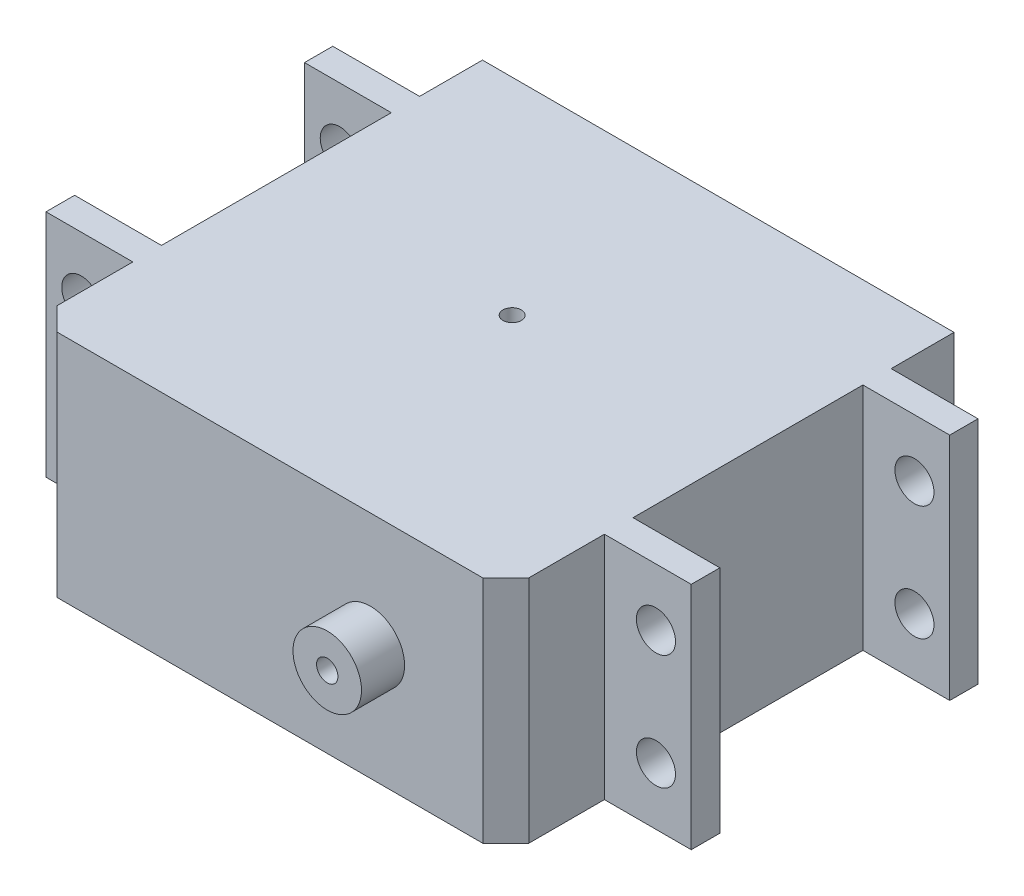
ISO-10303-21;
HEADER;
FILE_DESCRIPTION(('STEP AP214'),'2;1');
FILE_NAME('part.step','',(''),(''),'','','');
FILE_SCHEMA(('AUTOMOTIVE_DESIGN { 1 0 10303 214 1 1 1 1 }'));
ENDSEC;
DATA;
#1=APPLICATION_CONTEXT('core data for automotive mechanical design processes');
#2=APPLICATION_PROTOCOL_DEFINITION('international standard','automotive_design',2000,#1);
#3=PRODUCT_CONTEXT('',#1,'mechanical');
#4=PRODUCT('Part','Part','',(#3));
#5=PRODUCT_RELATED_PRODUCT_CATEGORY('part','',(#4));
#6=PRODUCT_DEFINITION_FORMATION('','',#4);
#7=PRODUCT_DEFINITION_CONTEXT('part definition',#1,'design');
#8=PRODUCT_DEFINITION('design','',#6,#7);
#9=PRODUCT_DEFINITION_SHAPE('','',#8);
#10=(LENGTH_UNIT() NAMED_UNIT(*) SI_UNIT(.MILLI.,.METRE.));
#11=(NAMED_UNIT(*) PLANE_ANGLE_UNIT() SI_UNIT($,.RADIAN.));
#12=(NAMED_UNIT(*) SI_UNIT($,.STERADIAN.) SOLID_ANGLE_UNIT());
#13=UNCERTAINTY_MEASURE_WITH_UNIT(LENGTH_MEASURE(1.E-05),#10,'distance_accuracy_value','');
#14=(GEOMETRIC_REPRESENTATION_CONTEXT(3) GLOBAL_UNCERTAINTY_ASSIGNED_CONTEXT((#13)) GLOBAL_UNIT_ASSIGNED_CONTEXT((#10,
#11,#12)) REPRESENTATION_CONTEXT('',''));
#15=CARTESIAN_POINT('',(0.,0.,0.));
#16=DIRECTION('',(0.,0.,1.));
#17=DIRECTION('',(1.,0.,0.));
#18=AXIS2_PLACEMENT_3D('',#15,#16,#17);
#19=CARTESIAN_POINT('',(-20.515,10.,-27.93));
#20=DIRECTION('',(0.,0.,1.));
#21=DIRECTION('',(1.,0.,0.));
#22=AXIS2_PLACEMENT_3D('',#19,#20,#21);
#23=PLANE('',#22);
#24=DIRECTION('',(0.,-1.,0.));
#25=VECTOR('',#24,1.);
#26=CARTESIAN_POINT('',(-20.515,-10.,-27.93));
#27=LINE('',#26,#25);
#28=CARTESIAN_POINT('',(-20.515,10.,-27.93));
#29=VERTEX_POINT('',#28);
#30=CARTESIAN_POINT('',(-20.515,-10.,-27.93));
#31=VERTEX_POINT('',#30);
#32=EDGE_CURVE('E202',#29,#31,#27,.T.);
#33=ORIENTED_EDGE('',*,*,#32,.F.);
#34=DIRECTION('',(-1.,0.,0.));
#35=VECTOR('',#34,1.);
#36=CARTESIAN_POINT('',(20.515,10.,-27.93));
#37=LINE('',#36,#35);
#38=CARTESIAN_POINT('',(20.515,10.,-27.93));
#39=VERTEX_POINT('',#38);
#40=EDGE_CURVE('E195',#39,#29,#37,.T.);
#41=ORIENTED_EDGE('',*,*,#40,.F.);
#42=DIRECTION('',(0.,1.,0.));
#43=VECTOR('',#42,1.);
#44=CARTESIAN_POINT('',(20.515,-10.,-27.93));
#45=LINE('',#44,#43);
#46=CARTESIAN_POINT('',(20.515,-10.,-27.93));
#47=VERTEX_POINT('',#46);
#48=EDGE_CURVE('E205',#47,#39,#45,.T.);
#49=ORIENTED_EDGE('',*,*,#48,.F.);
#50=DIRECTION('',(1.,0.,0.));
#51=VECTOR('',#50,1.);
#52=CARTESIAN_POINT('',(20.515,-10.,-27.93));
#53=LINE('',#52,#51);
#54=EDGE_CURVE('E188',#31,#47,#53,.T.);
#55=ORIENTED_EDGE('',*,*,#54,.F.);
#56=EDGE_LOOP('',(#33,#41,#49,#55));
#57=FACE_BOUND('',#56,.T.);
#58=CARTESIAN_POINT('',(8.73,0.,-27.93));
#59=DIRECTION('',(0.,0.,1.));
#60=DIRECTION('',(1.,0.,0.));
#61=AXIS2_PLACEMENT_3D('',#58,#59,#60);
#62=CIRCLE('',#61,6.18);
#63=CARTESIAN_POINT('',(14.91,0.,-27.93));
#64=VERTEX_POINT('',#63);
#65=EDGE_CURVE('E12',#64,#64,#62,.F.);
#66=ORIENTED_EDGE('',*,*,#65,.F.);
#67=EDGE_LOOP('',(#66));
#68=FACE_BOUND('',#67,.T.);
#69=ADVANCED_FACE('F34',(#57,#68),#23,.F.);
#70=CARTESIAN_POINT('',(-28.07,9.99999999999999,-22.46));
#71=DIRECTION('',(0.,0.,1.));
#72=DIRECTION('',(1.,0.,0.));
#73=AXIS2_PLACEMENT_3D('',#70,#71,#72);
#74=PLANE('',#73);
#75=CARTESIAN_POINT('',(-25.,-5.,-22.46));
#76=DIRECTION('',(0.,0.,1.));
#77=DIRECTION('',(1.,0.,0.));
#78=AXIS2_PLACEMENT_3D('',#75,#76,#77);
#79=CIRCLE('',#78,1.7);
#80=CARTESIAN_POINT('',(-23.3,-5.,-22.46));
#81=VERTEX_POINT('',#80);
#82=EDGE_CURVE('E241',#81,#81,#79,.T.);
#83=ORIENTED_EDGE('',*,*,#82,.T.);
#84=EDGE_LOOP('',(#83));
#85=FACE_BOUND('',#84,.T.);
#86=CARTESIAN_POINT('',(-25.,5.,-22.46));
#87=DIRECTION('',(0.,0.,1.));
#88=DIRECTION('',(1.,0.,0.));
#89=AXIS2_PLACEMENT_3D('',#86,#87,#88);
#90=CIRCLE('',#89,1.7);
#91=CARTESIAN_POINT('',(-23.3,5.,-22.46));
#92=VERTEX_POINT('',#91);
#93=EDGE_CURVE('E235',#92,#92,#90,.T.);
#94=ORIENTED_EDGE('',*,*,#93,.T.);
#95=EDGE_LOOP('',(#94));
#96=FACE_BOUND('',#95,.T.);
#97=DIRECTION('',(-1.,0.,0.));
#98=VECTOR('',#97,1.);
#99=CARTESIAN_POINT('',(-28.07,10.,-22.46));
#100=LINE('',#99,#98);
#101=CARTESIAN_POINT('',(-20.515,10.,-22.46));
#102=VERTEX_POINT('',#101);
#103=CARTESIAN_POINT('',(-28.07,10.,-22.46));
#104=VERTEX_POINT('',#103);
#105=EDGE_CURVE('E288',#102,#104,#100,.T.);
#106=ORIENTED_EDGE('',*,*,#105,.F.);
#107=DIRECTION('',(0.,-1.,0.));
#108=VECTOR('',#107,1.);
#109=CARTESIAN_POINT('',(-20.515,9.99999999999999,-22.46));
#110=LINE('',#109,#108);
#111=CARTESIAN_POINT('',(-20.515,-10.,-22.46));
#112=VERTEX_POINT('',#111);
#113=EDGE_CURVE('E399',#102,#112,#110,.T.);
#114=ORIENTED_EDGE('',*,*,#113,.T.);
#115=DIRECTION('',(1.,0.,0.));
#116=VECTOR('',#115,1.);
#117=CARTESIAN_POINT('',(-28.07,-10.,-22.46));
#118=LINE('',#117,#116);
#119=CARTESIAN_POINT('',(-28.07,-10.,-22.46));
#120=VERTEX_POINT('',#119);
#121=EDGE_CURVE('E190',#120,#112,#118,.T.);
#122=ORIENTED_EDGE('',*,*,#121,.F.);
#123=DIRECTION('',(0.,-1.,0.));
#124=VECTOR('',#123,1.);
#125=CARTESIAN_POINT('',(-28.07,-10.,-22.46));
#126=LINE('',#125,#124);
#127=EDGE_CURVE('E248',#104,#120,#126,.T.);
#128=ORIENTED_EDGE('',*,*,#127,.F.);
#129=EDGE_LOOP('',(#106,#114,#122,#128));
#130=FACE_BOUND('',#129,.T.);
#131=ADVANCED_FACE('F298',(#85,#96,#130),#74,.F.);
#132=CARTESIAN_POINT('',(-28.07,9.99999999999999,0.));
#133=DIRECTION('',(0.,0.,1.));
#134=DIRECTION('',(1.,0.,0.));
#135=AXIS2_PLACEMENT_3D('',#132,#133,#134);
#136=PLANE('',#135);
#137=CARTESIAN_POINT('',(25.,-5.,0.));
#138=DIRECTION('',(0.,0.,1.));
#139=DIRECTION('',(1.,0.,0.));
#140=AXIS2_PLACEMENT_3D('',#137,#138,#139);
#141=CIRCLE('',#140,1.7);
#142=CARTESIAN_POINT('',(26.7,-5.,0.));
#143=VERTEX_POINT('',#142);
#144=EDGE_CURVE('E959',#143,#143,#141,.T.);
#145=ORIENTED_EDGE('',*,*,#144,.T.);
#146=EDGE_LOOP('',(#145));
#147=FACE_BOUND('',#146,.T.);
#148=CARTESIAN_POINT('',(25.,5.,0.));
#149=DIRECTION('',(0.,0.,1.));
#150=DIRECTION('',(1.,0.,0.));
#151=AXIS2_PLACEMENT_3D('',#148,#149,#150);
#152=CIRCLE('',#151,1.7);
#153=CARTESIAN_POINT('',(26.7,5.,0.));
#154=VERTEX_POINT('',#153);
#155=EDGE_CURVE('E468',#154,#154,#152,.T.);
#156=ORIENTED_EDGE('',*,*,#155,.T.);
#157=EDGE_LOOP('',(#156));
#158=FACE_BOUND('',#157,.T.);
#159=DIRECTION('',(0.,-1.,0.));
#160=VECTOR('',#159,1.);
#161=CARTESIAN_POINT('',(20.515,-10.,0.));
#162=LINE('',#161,#160);
#163=CARTESIAN_POINT('',(20.515,10.,0.));
#164=VERTEX_POINT('',#163);
#165=CARTESIAN_POINT('',(20.515,-10.,0.));
#166=VERTEX_POINT('',#165);
#167=EDGE_CURVE('E257',#164,#166,#162,.T.);
#168=ORIENTED_EDGE('',*,*,#167,.F.);
#169=DIRECTION('',(-1.,0.,0.));
#170=VECTOR('',#169,1.);
#171=CARTESIAN_POINT('',(28.07,10.,0.));
#172=LINE('',#171,#170);
#173=CARTESIAN_POINT('',(28.07,10.,0.));
#174=VERTEX_POINT('',#173);
#175=EDGE_CURVE('E436',#174,#164,#172,.T.);
#176=ORIENTED_EDGE('',*,*,#175,.F.);
#177=DIRECTION('',(0.,1.,0.));
#178=VECTOR('',#177,1.);
#179=CARTESIAN_POINT('',(28.07,-10.,0.));
#180=LINE('',#179,#178);
#181=CARTESIAN_POINT('',(28.07,-10.,0.));
#182=VERTEX_POINT('',#181);
#183=EDGE_CURVE('E446',#182,#174,#180,.T.);
#184=ORIENTED_EDGE('',*,*,#183,.F.);
#185=DIRECTION('',(1.,0.,0.));
#186=VECTOR('',#185,1.);
#187=CARTESIAN_POINT('',(28.07,-10.,0.));
#188=LINE('',#187,#186);
#189=EDGE_CURVE('E324',#166,#182,#188,.T.);
#190=ORIENTED_EDGE('',*,*,#189,.F.);
#191=EDGE_LOOP('',(#168,#176,#184,#190));
#192=FACE_BOUND('',#191,.T.);
#193=ADVANCED_FACE('F434',(#147,#158,#192),#136,.F.);
#194=CARTESIAN_POINT('',(-25.,-5.,0.));
#195=DIRECTION('',(0.,0.,1.));
#196=DIRECTION('',(1.,0.,0.));
#197=AXIS2_PLACEMENT_3D('',#194,#195,#196);
#198=CIRCLE('',#197,1.7);
#199=CARTESIAN_POINT('',(-23.3,-5.,0.));
#200=VERTEX_POINT('',#199);
#201=EDGE_CURVE('E463',#200,#200,#198,.T.);
#202=ORIENTED_EDGE('',*,*,#201,.T.);
#203=EDGE_LOOP('',(#202));
#204=FACE_BOUND('',#203,.T.);
#205=CARTESIAN_POINT('',(-25.,5.,0.));
#206=DIRECTION('',(0.,0.,1.));
#207=DIRECTION('',(1.,0.,0.));
#208=AXIS2_PLACEMENT_3D('',#205,#206,#207);
#209=CIRCLE('',#208,1.7);
#210=CARTESIAN_POINT('',(-23.3,5.,0.));
#211=VERTEX_POINT('',#210);
#212=EDGE_CURVE('E958',#211,#211,#209,.T.);
#213=ORIENTED_EDGE('',*,*,#212,.T.);
#214=EDGE_LOOP('',(#213));
#215=FACE_BOUND('',#214,.T.);
#216=DIRECTION('',(0.,1.,0.));
#217=VECTOR('',#216,1.);
#218=CARTESIAN_POINT('',(-20.515,-10.,0.));
#219=LINE('',#218,#217);
#220=CARTESIAN_POINT('',(-20.515,-10.,0.));
#221=VERTEX_POINT('',#220);
#222=CARTESIAN_POINT('',(-20.515,10.,0.));
#223=VERTEX_POINT('',#222);
#224=EDGE_CURVE('E314',#221,#223,#219,.T.);
#225=ORIENTED_EDGE('',*,*,#224,.F.);
#226=CARTESIAN_POINT('',(-28.07,-10.,0.));
#227=VERTEX_POINT('',#226);
#228=EDGE_CURVE('E506',#227,#221,#188,.T.);
#229=ORIENTED_EDGE('',*,*,#228,.F.);
#230=DIRECTION('',(0.,-1.,0.));
#231=VECTOR('',#230,1.);
#232=CARTESIAN_POINT('',(-28.07,-10.,0.));
#233=LINE('',#232,#231);
#234=CARTESIAN_POINT('',(-28.07,9.99999999999999,0.));
#235=VERTEX_POINT('',#234);
#236=EDGE_CURVE('E486',#235,#227,#233,.T.);
#237=ORIENTED_EDGE('',*,*,#236,.F.);
#238=EDGE_CURVE('E442',#223,#235,#172,.T.);
#239=ORIENTED_EDGE('',*,*,#238,.F.);
#240=EDGE_LOOP('',(#225,#229,#237,#239));
#241=FACE_BOUND('',#240,.T.);
#242=ADVANCED_FACE('F613',(#204,#215,#241),#136,.F.);
#243=CARTESIAN_POINT('',(-20.515,10.,11.07));
#244=DIRECTION('',(0.,0.,1.));
#245=DIRECTION('',(1.,0.,0.));
#246=AXIS2_PLACEMENT_3D('',#243,#244,#245);
#247=PLANE('',#246);
#248=DIRECTION('',(-1.,0.,0.));
#249=VECTOR('',#248,1.);
#250=CARTESIAN_POINT('',(20.515,10.,11.07));
#251=LINE('',#250,#249);
#252=CARTESIAN_POINT('',(18.515,10.,11.07));
#253=VERTEX_POINT('',#252);
#254=CARTESIAN_POINT('',(-18.515,10.,11.07));
#255=VERTEX_POINT('',#254);
#256=EDGE_CURVE('E350',#253,#255,#251,.T.);
#257=ORIENTED_EDGE('',*,*,#256,.T.);
#258=DIRECTION('',(0.,-1.,0.));
#259=VECTOR('',#258,1.);
#260=CARTESIAN_POINT('',(-18.515,-10.,11.07));
#261=LINE('',#260,#259);
#262=CARTESIAN_POINT('',(-18.515,-10.,11.07));
#263=VERTEX_POINT('',#262);
#264=EDGE_CURVE('E388',#255,#263,#261,.T.);
#265=ORIENTED_EDGE('',*,*,#264,.T.);
#266=DIRECTION('',(1.,0.,0.));
#267=VECTOR('',#266,1.);
#268=CARTESIAN_POINT('',(20.515,-10.,11.07));
#269=LINE('',#268,#267);
#270=CARTESIAN_POINT('',(18.515,-10.,11.07));
#271=VERTEX_POINT('',#270);
#272=EDGE_CURVE('E347',#263,#271,#269,.T.);
#273=ORIENTED_EDGE('',*,*,#272,.T.);
#274=DIRECTION('',(0.,1.,0.));
#275=VECTOR('',#274,1.);
#276=CARTESIAN_POINT('',(18.515,10.,11.07));
#277=LINE('',#276,#275);
#278=EDGE_CURVE('E395',#271,#253,#277,.T.);
#279=ORIENTED_EDGE('',*,*,#278,.T.);
#280=EDGE_LOOP('',(#257,#265,#273,#279));
#281=FACE_BOUND('',#280,.T.);
#282=CARTESIAN_POINT('',(8.73,0.,11.07));
#283=DIRECTION('',(0.,0.,1.));
#284=DIRECTION('',(1.,0.,0.));
#285=AXIS2_PLACEMENT_3D('',#282,#283,#284);
#286=CIRCLE('',#285,2.98);
#287=CARTESIAN_POINT('',(11.71,0.,11.07));
#288=VERTEX_POINT('',#287);
#289=EDGE_CURVE('E339',#288,#288,#286,.T.);
#290=ORIENTED_EDGE('',*,*,#289,.F.);
#291=EDGE_LOOP('',(#290));
#292=FACE_BOUND('',#291,.T.);
#293=ADVANCED_FACE('F609',(#281,#292),#247,.T.);
#294=CARTESIAN_POINT('',(-28.07,9.99999999999999,2.49));
#295=DIRECTION('',(0.,0.,1.));
#296=DIRECTION('',(1.,0.,0.));
#297=AXIS2_PLACEMENT_3D('',#294,#295,#296);
#298=PLANE('',#297);
#299=DIRECTION('',(0.,-1.,0.));
#300=VECTOR('',#299,1.);
#301=CARTESIAN_POINT('',(-20.515,-10.,2.49));
#302=LINE('',#301,#300);
#303=CARTESIAN_POINT('',(-20.515,10.,2.49));
#304=VERTEX_POINT('',#303);
#305=CARTESIAN_POINT('',(-20.515,-10.,2.49));
#306=VERTEX_POINT('',#305);
#307=EDGE_CURVE('E344',#304,#306,#302,.T.);
#308=ORIENTED_EDGE('',*,*,#307,.F.);
#309=DIRECTION('',(-1.,0.,0.));
#310=VECTOR('',#309,1.);
#311=CARTESIAN_POINT('',(28.07,10.,2.49));
#312=LINE('',#311,#310);
#313=CARTESIAN_POINT('',(-28.07,9.99999999999999,2.49));
#314=VERTEX_POINT('',#313);
#315=EDGE_CURVE('E483',#304,#314,#312,.T.);
#316=ORIENTED_EDGE('',*,*,#315,.T.);
#317=DIRECTION('',(0.,-1.,0.));
#318=VECTOR('',#317,1.);
#319=CARTESIAN_POINT('',(-28.07,-10.,2.49));
#320=LINE('',#319,#318);
#321=CARTESIAN_POINT('',(-28.07,-10.,2.49));
#322=VERTEX_POINT('',#321);
#323=EDGE_CURVE('E441',#314,#322,#320,.T.);
#324=ORIENTED_EDGE('',*,*,#323,.T.);
#325=DIRECTION('',(1.,0.,0.));
#326=VECTOR('',#325,1.);
#327=CARTESIAN_POINT('',(28.07,-10.,2.49));
#328=LINE('',#327,#326);
#329=EDGE_CURVE('E472',#322,#306,#328,.T.);
#330=ORIENTED_EDGE('',*,*,#329,.T.);
#331=EDGE_LOOP('',(#308,#316,#324,#330));
#332=FACE_BOUND('',#331,.T.);
#333=CARTESIAN_POINT('',(-25.,-5.,2.49));
#334=DIRECTION('',(0.,0.,1.));
#335=DIRECTION('',(1.,0.,0.));
#336=AXIS2_PLACEMENT_3D('',#333,#334,#335);
#337=CIRCLE('',#336,1.7);
#338=CARTESIAN_POINT('',(-23.3,-5.,2.49));
#339=VERTEX_POINT('',#338);
#340=EDGE_CURVE('E467',#339,#339,#337,.T.);
#341=ORIENTED_EDGE('',*,*,#340,.F.);
#342=EDGE_LOOP('',(#341));
#343=FACE_BOUND('',#342,.T.);
#344=CARTESIAN_POINT('',(-25.,5.,2.49));
#345=DIRECTION('',(0.,0.,1.));
#346=DIRECTION('',(1.,0.,0.));
#347=AXIS2_PLACEMENT_3D('',#344,#345,#346);
#348=CIRCLE('',#347,1.7);
#349=CARTESIAN_POINT('',(-23.3,5.,2.49));
#350=VERTEX_POINT('',#349);
#351=EDGE_CURVE('E471',#350,#350,#348,.T.);
#352=ORIENTED_EDGE('',*,*,#351,.F.);
#353=EDGE_LOOP('',(#352));
#354=FACE_BOUND('',#353,.T.);
#355=ADVANCED_FACE('F496',(#332,#343,#354),#298,.T.);
#356=CARTESIAN_POINT('',(-28.07,-10.,2.49));
#357=DIRECTION('',(1.,0.,0.));
#358=DIRECTION('',(0.,0.,-1.));
#359=AXIS2_PLACEMENT_3D('',#356,#357,#358);
#360=PLANE('',#359);
#361=ORIENTED_EDGE('',*,*,#236,.T.);
#362=DIRECTION('',(0.,0.,-1.));
#363=VECTOR('',#362,1.);
#364=CARTESIAN_POINT('',(-28.07,-10.,2.49));
#365=LINE('',#364,#363);
#366=EDGE_CURVE('E460',#322,#227,#365,.T.);
#367=ORIENTED_EDGE('',*,*,#366,.F.);
#368=ORIENTED_EDGE('',*,*,#323,.F.);
#369=DIRECTION('',(0.,0.,-1.));
#370=VECTOR('',#369,1.);
#371=CARTESIAN_POINT('',(-28.07,9.99999999999999,2.49));
#372=LINE('',#371,#370);
#373=EDGE_CURVE('E452',#314,#235,#372,.T.);
#374=ORIENTED_EDGE('',*,*,#373,.T.);
#375=EDGE_LOOP('',(#361,#367,#368,#374));
#376=FACE_BOUND('',#375,.T.);
#377=ADVANCED_FACE('F503',(#376),#360,.F.);
#378=CARTESIAN_POINT('',(28.07,-10.,2.49));
#379=DIRECTION('',(0.,1.,0.));
#380=DIRECTION('',(-1.,0.,0.));
#381=AXIS2_PLACEMENT_3D('',#378,#379,#380);
#382=PLANE('',#381);
#383=CARTESIAN_POINT('',(0.,-10.,-10.));
#384=DIRECTION('',(0.,-1.,0.));
#385=DIRECTION('',(0.,0.,-1.));
#386=AXIS2_PLACEMENT_3D('',#383,#384,#385);
#387=CIRCLE('',#386,0.799999999999988);
#388=CARTESIAN_POINT('',(0.,-10.,-10.8));
#389=VERTEX_POINT('',#388);
#390=EDGE_CURVE('E407',#389,#389,#387,.T.);
#391=ORIENTED_EDGE('',*,*,#390,.F.);
#392=EDGE_LOOP('',(#391));
#393=FACE_BOUND('',#392,.T.);
#394=ORIENTED_EDGE('',*,*,#272,.F.);
#395=DIRECTION('',(-0.707106781186546,0.,-0.707106781186549));
#396=VECTOR('',#395,1.);
#397=CARTESIAN_POINT('',(-18.515,-10.,11.07));
#398=LINE('',#397,#396);
#399=CARTESIAN_POINT('',(-20.515,-10.,9.07000000000001));
#400=VERTEX_POINT('',#399);
#401=EDGE_CURVE('E373',#263,#400,#398,.T.);
#402=ORIENTED_EDGE('',*,*,#401,.T.);
#403=DIRECTION('',(0.,0.,-1.));
#404=VECTOR('',#403,1.);
#405=CARTESIAN_POINT('',(-20.515,-10.,11.07));
#406=LINE('',#405,#404);
#407=EDGE_CURVE('E387',#400,#306,#406,.T.);
#408=ORIENTED_EDGE('',*,*,#407,.T.);
#409=ORIENTED_EDGE('',*,*,#329,.F.);
#410=ORIENTED_EDGE('',*,*,#366,.T.);
#411=ORIENTED_EDGE('',*,*,#228,.T.);
#412=DIRECTION('',(0.,0.,1.));
#413=VECTOR('',#412,1.);
#414=CARTESIAN_POINT('',(-20.515,-10.,-65.6449438601911));
#415=LINE('',#414,#413);
#416=CARTESIAN_POINT('',(-20.515,-10.,-20.));
#417=VERTEX_POINT('',#416);
#418=EDGE_CURVE('E315',#417,#221,#415,.T.);
#419=ORIENTED_EDGE('',*,*,#418,.F.);
#420=DIRECTION('',(-1.,0.,0.));
#421=VECTOR('',#420,1.);
#422=CARTESIAN_POINT('',(-28.07,-10.,-20.));
#423=LINE('',#422,#421);
#424=CARTESIAN_POINT('',(-28.07,-10.,-20.));
#425=VERTEX_POINT('',#424);
#426=EDGE_CURVE('E260',#417,#425,#423,.T.);
#427=ORIENTED_EDGE('',*,*,#426,.T.);
#428=DIRECTION('',(0.,0.,1.));
#429=VECTOR('',#428,1.);
#430=CARTESIAN_POINT('',(-28.07,-10.,-107.006137458731));
#431=LINE('',#430,#429);
#432=EDGE_CURVE('E284',#120,#425,#431,.T.);
#433=ORIENTED_EDGE('',*,*,#432,.F.);
#434=ORIENTED_EDGE('',*,*,#121,.T.);
#435=DIRECTION('',(0.,0.,1.));
#436=VECTOR('',#435,1.);
#437=CARTESIAN_POINT('',(-20.515,-10.,-27.93));
#438=LINE('',#437,#436);
#439=EDGE_CURVE('E184',#31,#112,#438,.T.);
#440=ORIENTED_EDGE('',*,*,#439,.F.);
#441=ORIENTED_EDGE('',*,*,#54,.T.);
#442=DIRECTION('',(0.,0.,1.));
#443=VECTOR('',#442,1.);
#444=CARTESIAN_POINT('',(20.515,-10.,-27.93));
#445=LINE('',#444,#443);
#446=CARTESIAN_POINT('',(20.515,-10.,-22.46));
#447=VERTEX_POINT('',#446);
#448=EDGE_CURVE('E194',#47,#447,#445,.T.);
#449=ORIENTED_EDGE('',*,*,#448,.T.);
#450=CARTESIAN_POINT('',(28.07,-10.,-22.46));
#451=VERTEX_POINT('',#450);
#452=EDGE_CURVE('E251',#447,#451,#118,.T.);
#453=ORIENTED_EDGE('',*,*,#452,.T.);
#454=DIRECTION('',(0.,0.,1.));
#455=VECTOR('',#454,1.);
#456=CARTESIAN_POINT('',(28.07,-10.,-107.006137458731));
#457=LINE('',#456,#455);
#458=CARTESIAN_POINT('',(28.07,-10.,-20.));
#459=VERTEX_POINT('',#458);
#460=EDGE_CURVE('E287',#451,#459,#457,.T.);
#461=ORIENTED_EDGE('',*,*,#460,.T.);
#462=CARTESIAN_POINT('',(20.515,-10.,-20.));
#463=VERTEX_POINT('',#462);
#464=EDGE_CURVE('E269',#459,#463,#423,.T.);
#465=ORIENTED_EDGE('',*,*,#464,.T.);
#466=DIRECTION('',(0.,0.,1.));
#467=VECTOR('',#466,1.);
#468=CARTESIAN_POINT('',(20.515,-10.,-65.6449438601911));
#469=LINE('',#468,#467);
#470=EDGE_CURVE('E318',#463,#166,#469,.T.);
#471=ORIENTED_EDGE('',*,*,#470,.T.);
#472=ORIENTED_EDGE('',*,*,#189,.T.);
#473=DIRECTION('',(0.,0.,-1.));
#474=VECTOR('',#473,1.);
#475=CARTESIAN_POINT('',(28.07,-10.,2.49));
#476=LINE('',#475,#474);
#477=CARTESIAN_POINT('',(28.07,-10.,2.49));
#478=VERTEX_POINT('',#477);
#479=EDGE_CURVE('E458',#478,#182,#476,.T.);
#480=ORIENTED_EDGE('',*,*,#479,.F.);
#481=CARTESIAN_POINT('',(20.515,-10.,2.49));
#482=VERTEX_POINT('',#481);
#483=EDGE_CURVE('E444',#482,#478,#328,.T.);
#484=ORIENTED_EDGE('',*,*,#483,.F.);
#485=DIRECTION('',(0.,0.,-1.));
#486=VECTOR('',#485,1.);
#487=CARTESIAN_POINT('',(20.515,-10.,11.07));
#488=LINE('',#487,#486);
#489=CARTESIAN_POINT('',(20.515,-10.,9.07));
#490=VERTEX_POINT('',#489);
#491=EDGE_CURVE('E378',#490,#482,#488,.T.);
#492=ORIENTED_EDGE('',*,*,#491,.F.);
#493=DIRECTION('',(-0.707106781186546,0.,0.707106781186549));
#494=VECTOR('',#493,1.);
#495=CARTESIAN_POINT('',(18.515,-10.,11.07));
#496=LINE('',#495,#494);
#497=EDGE_CURVE('E391',#490,#271,#496,.T.);
#498=ORIENTED_EDGE('',*,*,#497,.T.);
#499=EDGE_LOOP('',(#394,#402,#408,#409,#410,#411,#419,#427,#433,#434,#440,#441,#449,#453,#461,
#465,#471,#472,#480,#484,#492,#498));
#500=FACE_BOUND('',#499,.T.);
#501=ADVANCED_FACE('F187',(#393,#500),#382,.F.);
#502=CARTESIAN_POINT('',(28.07,-10.,2.49));
#503=DIRECTION('',(-1.,0.,0.));
#504=DIRECTION('',(0.,0.,1.));
#505=AXIS2_PLACEMENT_3D('',#502,#503,#504);
#506=PLANE('',#505);
#507=ORIENTED_EDGE('',*,*,#183,.T.);
#508=DIRECTION('',(0.,0.,-1.));
#509=VECTOR('',#508,1.);
#510=CARTESIAN_POINT('',(28.07,10.,2.49));
#511=LINE('',#510,#509);
#512=CARTESIAN_POINT('',(28.07,10.,2.49));
#513=VERTEX_POINT('',#512);
#514=EDGE_CURVE('E440',#513,#174,#511,.T.);
#515=ORIENTED_EDGE('',*,*,#514,.F.);
#516=DIRECTION('',(0.,1.,0.));
#517=VECTOR('',#516,1.);
#518=CARTESIAN_POINT('',(28.07,-10.,2.49));
#519=LINE('',#518,#517);
#520=EDGE_CURVE('E476',#478,#513,#519,.T.);
#521=ORIENTED_EDGE('',*,*,#520,.F.);
#522=ORIENTED_EDGE('',*,*,#479,.T.);
#523=EDGE_LOOP('',(#507,#515,#521,#522));
#524=FACE_BOUND('',#523,.T.);
#525=ADVANCED_FACE('F590',(#524),#506,.F.);
#526=CARTESIAN_POINT('',(28.07,10.,2.49));
#527=DIRECTION('',(0.,-1.,0.));
#528=DIRECTION('',(1.,0.,0.));
#529=AXIS2_PLACEMENT_3D('',#526,#527,#528);
#530=PLANE('',#529);
#531=CARTESIAN_POINT('',(0.,10.,-10.));
#532=DIRECTION('',(0.,-1.,0.));
#533=DIRECTION('',(1.,0.,0.));
#534=AXIS2_PLACEMENT_3D('',#531,#532,#533);
#535=CIRCLE('',#534,0.799999999999992);
#536=CARTESIAN_POINT('',(0.799999999999981,10.,-10.));
#537=VERTEX_POINT('',#536);
#538=EDGE_CURVE('E404',#537,#537,#535,.T.);
#539=ORIENTED_EDGE('',*,*,#538,.T.);
#540=EDGE_LOOP('',(#539));
#541=FACE_BOUND('',#540,.T.);
#542=DIRECTION('',(0.,0.,-1.));
#543=VECTOR('',#542,1.);
#544=CARTESIAN_POINT('',(-20.515,10.,11.07));
#545=LINE('',#544,#543);
#546=CARTESIAN_POINT('',(-20.515,10.,9.07000000000001));
#547=VERTEX_POINT('',#546);
#548=EDGE_CURVE('E354',#547,#304,#545,.T.);
#549=ORIENTED_EDGE('',*,*,#548,.F.);
#550=DIRECTION('',(0.707106781186546,0.,0.707106781186549));
#551=VECTOR('',#550,1.);
#552=CARTESIAN_POINT('',(-18.515,10.,11.07));
#553=LINE('',#552,#551);
#554=EDGE_CURVE('E509',#547,#255,#553,.T.);
#555=ORIENTED_EDGE('',*,*,#554,.T.);
#556=ORIENTED_EDGE('',*,*,#256,.F.);
#557=DIRECTION('',(0.707106781186546,0.,-0.707106781186549));
#558=VECTOR('',#557,1.);
#559=CARTESIAN_POINT('',(18.515,10.,11.07));
#560=LINE('',#559,#558);
#561=CARTESIAN_POINT('',(20.515,10.,9.07000000000001));
#562=VERTEX_POINT('',#561);
#563=EDGE_CURVE('E49',#253,#562,#560,.T.);
#564=ORIENTED_EDGE('',*,*,#563,.T.);
#565=DIRECTION('',(0.,0.,-1.));
#566=VECTOR('',#565,1.);
#567=CARTESIAN_POINT('',(20.515,10.,11.07));
#568=LINE('',#567,#566);
#569=CARTESIAN_POINT('',(20.515,10.,2.49));
#570=VERTEX_POINT('',#569);
#571=EDGE_CURVE('E372',#562,#570,#568,.T.);
#572=ORIENTED_EDGE('',*,*,#571,.T.);
#573=EDGE_CURVE('E456',#513,#570,#312,.T.);
#574=ORIENTED_EDGE('',*,*,#573,.F.);
#575=ORIENTED_EDGE('',*,*,#514,.T.);
#576=ORIENTED_EDGE('',*,*,#175,.T.);
#577=DIRECTION('',(0.,0.,1.));
#578=VECTOR('',#577,1.);
#579=CARTESIAN_POINT('',(20.515,10.,-65.6449438601911));
#580=LINE('',#579,#578);
#581=CARTESIAN_POINT('',(20.515,10.,-20.));
#582=VERTEX_POINT('',#581);
#583=EDGE_CURVE('E316',#582,#164,#580,.T.);
#584=ORIENTED_EDGE('',*,*,#583,.F.);
#585=DIRECTION('',(1.,0.,0.));
#586=VECTOR('',#585,1.);
#587=CARTESIAN_POINT('',(-28.07,10.,-20.));
#588=LINE('',#587,#586);
#589=CARTESIAN_POINT('',(28.07,10.,-20.));
#590=VERTEX_POINT('',#589);
#591=EDGE_CURVE('E272',#582,#590,#588,.T.);
#592=ORIENTED_EDGE('',*,*,#591,.T.);
#593=DIRECTION('',(0.,0.,1.));
#594=VECTOR('',#593,1.);
#595=CARTESIAN_POINT('',(28.07,10.,-107.006137458731));
#596=LINE('',#595,#594);
#597=CARTESIAN_POINT('',(28.07,10.,-22.46));
#598=VERTEX_POINT('',#597);
#599=EDGE_CURVE('E278',#598,#590,#596,.T.);
#600=ORIENTED_EDGE('',*,*,#599,.F.);
#601=CARTESIAN_POINT('',(20.515,10.,-22.46));
#602=VERTEX_POINT('',#601);
#603=EDGE_CURVE('E252',#598,#602,#100,.T.);
#604=ORIENTED_EDGE('',*,*,#603,.T.);
#605=DIRECTION('',(0.,0.,1.));
#606=VECTOR('',#605,1.);
#607=CARTESIAN_POINT('',(20.515,10.,-27.93));
#608=LINE('',#607,#606);
#609=EDGE_CURVE('E221',#39,#602,#608,.T.);
#610=ORIENTED_EDGE('',*,*,#609,.F.);
#611=ORIENTED_EDGE('',*,*,#40,.T.);
#612=DIRECTION('',(0.,0.,1.));
#613=VECTOR('',#612,1.);
#614=CARTESIAN_POINT('',(-20.515,10.,-27.93));
#615=LINE('',#614,#613);
#616=EDGE_CURVE('E209',#29,#102,#615,.T.);
#617=ORIENTED_EDGE('',*,*,#616,.T.);
#618=ORIENTED_EDGE('',*,*,#105,.T.);
#619=DIRECTION('',(0.,0.,1.));
#620=VECTOR('',#619,1.);
#621=CARTESIAN_POINT('',(-28.07,10.,-107.006137458731));
#622=LINE('',#621,#620);
#623=CARTESIAN_POINT('',(-28.07,10.,-20.));
#624=VERTEX_POINT('',#623);
#625=EDGE_CURVE('E282',#104,#624,#622,.T.);
#626=ORIENTED_EDGE('',*,*,#625,.T.);
#627=CARTESIAN_POINT('',(-20.515,10.,-20.));
#628=VERTEX_POINT('',#627);
#629=EDGE_CURVE('E274',#624,#628,#588,.T.);
#630=ORIENTED_EDGE('',*,*,#629,.T.);
#631=DIRECTION('',(0.,0.,1.));
#632=VECTOR('',#631,1.);
#633=CARTESIAN_POINT('',(-20.515,10.,-65.6449438601911));
#634=LINE('',#633,#632);
#635=EDGE_CURVE('E309',#628,#223,#634,.T.);
#636=ORIENTED_EDGE('',*,*,#635,.T.);
#637=ORIENTED_EDGE('',*,*,#238,.T.);
#638=ORIENTED_EDGE('',*,*,#373,.F.);
#639=ORIENTED_EDGE('',*,*,#315,.F.);
#640=EDGE_LOOP('',(#549,#555,#556,#564,#572,#574,#575,#576,#584,#592,#600,#604,#610,#611,#617,
#618,#626,#630,#636,#637,#638,#639));
#641=FACE_BOUND('',#640,.T.);
#642=ADVANCED_FACE('F293',(#541,#641),#530,.F.);
#643=DIRECTION('',(0.,1.,0.));
#644=VECTOR('',#643,1.);
#645=CARTESIAN_POINT('',(20.515,-10.,2.49));
#646=LINE('',#645,#644);
#647=EDGE_CURVE('E351',#482,#570,#646,.T.);
#648=ORIENTED_EDGE('',*,*,#647,.F.);
#649=ORIENTED_EDGE('',*,*,#483,.T.);
#650=ORIENTED_EDGE('',*,*,#520,.T.);
#651=ORIENTED_EDGE('',*,*,#573,.T.);
#652=EDGE_LOOP('',(#648,#649,#650,#651));
#653=FACE_BOUND('',#652,.T.);
#654=CARTESIAN_POINT('',(25.,5.,2.49));
#655=DIRECTION('',(0.,0.,1.));
#656=DIRECTION('',(1.,0.,0.));
#657=AXIS2_PLACEMENT_3D('',#654,#655,#656);
#658=CIRCLE('',#657,1.7);
#659=CARTESIAN_POINT('',(26.7,5.,2.49));
#660=VERTEX_POINT('',#659);
#661=EDGE_CURVE('E390',#660,#660,#658,.T.);
#662=ORIENTED_EDGE('',*,*,#661,.F.);
#663=EDGE_LOOP('',(#662));
#664=FACE_BOUND('',#663,.T.);
#665=CARTESIAN_POINT('',(25.,-5.,2.49));
#666=DIRECTION('',(0.,0.,1.));
#667=DIRECTION('',(1.,0.,0.));
#668=AXIS2_PLACEMENT_3D('',#665,#666,#667);
#669=CIRCLE('',#668,1.7);
#670=CARTESIAN_POINT('',(26.7,-5.,2.49));
#671=VERTEX_POINT('',#670);
#672=EDGE_CURVE('E466',#671,#671,#669,.T.);
#673=ORIENTED_EDGE('',*,*,#672,.F.);
#674=EDGE_LOOP('',(#673));
#675=FACE_BOUND('',#674,.T.);
#676=ADVANCED_FACE('F589',(#653,#664,#675),#298,.T.);
#677=CARTESIAN_POINT('',(25.,-5.,2.49));
#678=DIRECTION('',(0.,0.,1.));
#679=DIRECTION('',(1.,0.,0.));
#680=AXIS2_PLACEMENT_3D('',#677,#678,#679);
#681=CYLINDRICAL_SURFACE('',#680,1.7);
#682=ORIENTED_EDGE('',*,*,#672,.T.);
#683=EDGE_LOOP('',(#682));
#684=FACE_BOUND('',#683,.T.);
#685=ORIENTED_EDGE('',*,*,#144,.F.);
#686=EDGE_LOOP('',(#685));
#687=FACE_BOUND('',#686,.T.);
#688=ADVANCED_FACE('F596',(#684,#687),#681,.F.);
#689=CARTESIAN_POINT('',(-25.,-5.,2.49));
#690=DIRECTION('',(0.,0.,1.));
#691=DIRECTION('',(1.,0.,0.));
#692=AXIS2_PLACEMENT_3D('',#689,#690,#691);
#693=CYLINDRICAL_SURFACE('',#692,1.7);
#694=ORIENTED_EDGE('',*,*,#340,.T.);
#695=EDGE_LOOP('',(#694));
#696=FACE_BOUND('',#695,.T.);
#697=ORIENTED_EDGE('',*,*,#201,.F.);
#698=EDGE_LOOP('',(#697));
#699=FACE_BOUND('',#698,.T.);
#700=ADVANCED_FACE('F619',(#696,#699),#693,.F.);
#701=CARTESIAN_POINT('',(-25.,5.,2.49));
#702=DIRECTION('',(0.,0.,1.));
#703=DIRECTION('',(1.,0.,0.));
#704=AXIS2_PLACEMENT_3D('',#701,#702,#703);
#705=CYLINDRICAL_SURFACE('',#704,1.7);
#706=ORIENTED_EDGE('',*,*,#351,.T.);
#707=EDGE_LOOP('',(#706));
#708=FACE_BOUND('',#707,.T.);
#709=ORIENTED_EDGE('',*,*,#212,.F.);
#710=EDGE_LOOP('',(#709));
#711=FACE_BOUND('',#710,.T.);
#712=ADVANCED_FACE('F623',(#708,#711),#705,.F.);
#713=CARTESIAN_POINT('',(25.,5.,2.49));
#714=DIRECTION('',(0.,0.,1.));
#715=DIRECTION('',(1.,0.,0.));
#716=AXIS2_PLACEMENT_3D('',#713,#714,#715);
#717=CYLINDRICAL_SURFACE('',#716,1.7);
#718=ORIENTED_EDGE('',*,*,#661,.T.);
#719=EDGE_LOOP('',(#718));
#720=FACE_BOUND('',#719,.T.);
#721=ORIENTED_EDGE('',*,*,#155,.F.);
#722=EDGE_LOOP('',(#721));
#723=FACE_BOUND('',#722,.T.);
#724=ADVANCED_FACE('F627',(#720,#723),#717,.F.);
#725=CARTESIAN_POINT('',(20.515,-10.,11.07));
#726=DIRECTION('',(-1.,0.,0.));
#727=DIRECTION('',(0.,0.,1.));
#728=AXIS2_PLACEMENT_3D('',#725,#726,#727);
#729=PLANE('',#728);
#730=ORIENTED_EDGE('',*,*,#571,.F.);
#731=DIRECTION('',(0.,-1.,0.));
#732=VECTOR('',#731,1.);
#733=CARTESIAN_POINT('',(20.515,-10.,9.07000000000001));
#734=LINE('',#733,#732);
#735=EDGE_CURVE('E42',#562,#490,#734,.T.);
#736=ORIENTED_EDGE('',*,*,#735,.T.);
#737=ORIENTED_EDGE('',*,*,#491,.T.);
#738=ORIENTED_EDGE('',*,*,#647,.T.);
#739=EDGE_LOOP('',(#730,#736,#737,#738));
#740=FACE_BOUND('',#739,.T.);
#741=ADVANCED_FACE('F514',(#740),#729,.F.);
#742=CARTESIAN_POINT('',(-20.515,-10.,11.07));
#743=DIRECTION('',(1.,0.,0.));
#744=DIRECTION('',(0.,0.,-1.));
#745=AXIS2_PLACEMENT_3D('',#742,#743,#744);
#746=PLANE('',#745);
#747=ORIENTED_EDGE('',*,*,#407,.F.);
#748=DIRECTION('',(0.,1.,0.));
#749=VECTOR('',#748,1.);
#750=CARTESIAN_POINT('',(-20.515,10.,9.07000000000001));
#751=LINE('',#750,#749);
#752=EDGE_CURVE('E57',#400,#547,#751,.T.);
#753=ORIENTED_EDGE('',*,*,#752,.T.);
#754=ORIENTED_EDGE('',*,*,#548,.T.);
#755=ORIENTED_EDGE('',*,*,#307,.T.);
#756=EDGE_LOOP('',(#747,#753,#754,#755));
#757=FACE_BOUND('',#756,.T.);
#758=ADVANCED_FACE('F507',(#757),#746,.F.);
#759=CARTESIAN_POINT('',(8.73,0.,14.82));
#760=DIRECTION('',(0.,0.,1.));
#761=DIRECTION('',(1.,0.,0.));
#762=AXIS2_PLACEMENT_3D('',#759,#760,#761);
#763=PLANE('',#762);
#764=CARTESIAN_POINT('',(8.73,0.,14.82));
#765=DIRECTION('',(0.,0.,1.));
#766=DIRECTION('',(1.,0.,0.));
#767=AXIS2_PLACEMENT_3D('',#764,#765,#766);
#768=CIRCLE('',#767,2.98);
#769=CARTESIAN_POINT('',(11.71,0.,14.82));
#770=VERTEX_POINT('',#769);
#771=EDGE_CURVE('E341',#770,#770,#768,.T.);
#772=ORIENTED_EDGE('',*,*,#771,.T.);
#773=EDGE_LOOP('',(#772));
#774=FACE_BOUND('',#773,.T.);
#775=CARTESIAN_POINT('',(8.73,0.,14.82));
#776=DIRECTION('',(0.,0.,1.));
#777=DIRECTION('',(1.,0.,0.));
#778=AXIS2_PLACEMENT_3D('',#775,#776,#777);
#779=CIRCLE('',#778,0.928997072179889);
#780=CARTESIAN_POINT('',(9.65899707217989,0.,14.82));
#781=VERTEX_POINT('',#780);
#782=EDGE_CURVE('E336',#781,#781,#779,.T.);
#783=ORIENTED_EDGE('',*,*,#782,.F.);
#784=EDGE_LOOP('',(#783));
#785=FACE_BOUND('',#784,.T.);
#786=ADVANCED_FACE('F634',(#774,#785),#763,.T.);
#787=CARTESIAN_POINT('',(8.73,0.,14.82));
#788=DIRECTION('',(0.,0.,-1.));
#789=DIRECTION('',(-1.,0.,0.));
#790=AXIS2_PLACEMENT_3D('',#787,#788,#789);
#791=CYLINDRICAL_SURFACE('',#790,2.98);
#792=ORIENTED_EDGE('',*,*,#771,.F.);
#793=EDGE_LOOP('',(#792));
#794=FACE_BOUND('',#793,.T.);
#795=ORIENTED_EDGE('',*,*,#289,.T.);
#796=EDGE_LOOP('',(#795));
#797=FACE_BOUND('',#796,.T.);
#798=ADVANCED_FACE('F640',(#794,#797),#791,.T.);
#799=CARTESIAN_POINT('',(8.73,0.,14.82));
#800=DIRECTION('',(0.,0.,-1.));
#801=DIRECTION('',(-1.,0.,0.));
#802=AXIS2_PLACEMENT_3D('',#799,#800,#801);
#803=CYLINDRICAL_SURFACE('',#802,0.928997072179889);
#804=ORIENTED_EDGE('',*,*,#782,.T.);
#805=EDGE_LOOP('',(#804));
#806=FACE_BOUND('',#805,.T.);
#807=CARTESIAN_POINT('',(8.73,0.,11.07));
#808=DIRECTION('',(0.,0.,1.));
#809=DIRECTION('',(1.,0.,0.));
#810=AXIS2_PLACEMENT_3D('',#807,#808,#809);
#811=CIRCLE('',#810,0.928997072179889);
#812=CARTESIAN_POINT('',(9.65899707217989,0.,11.07));
#813=VERTEX_POINT('',#812);
#814=EDGE_CURVE('E367',#813,#813,#811,.F.);
#815=ORIENTED_EDGE('',*,*,#814,.T.);
#816=EDGE_LOOP('',(#815));
#817=FACE_BOUND('',#816,.T.);
#818=ADVANCED_FACE('F638',(#806,#817),#803,.F.);
#819=ORIENTED_EDGE('',*,*,#814,.F.);
#820=EDGE_LOOP('',(#819));
#821=FACE_BOUND('',#820,.T.);
#822=ADVANCED_FACE('F615',(#821),#247,.T.);
#823=CARTESIAN_POINT('',(20.515,-10.,-65.6449438601911));
#824=DIRECTION('',(-1.,0.,0.));
#825=DIRECTION('',(0.,0.,1.));
#826=AXIS2_PLACEMENT_3D('',#823,#824,#825);
#827=PLANE('',#826);
#828=ORIENTED_EDGE('',*,*,#470,.F.);
#829=DIRECTION('',(0.,1.,0.));
#830=VECTOR('',#829,1.);
#831=CARTESIAN_POINT('',(20.515,-10.,-20.));
#832=LINE('',#831,#830);
#833=EDGE_CURVE('E340',#463,#582,#832,.T.);
#834=ORIENTED_EDGE('',*,*,#833,.T.);
#835=ORIENTED_EDGE('',*,*,#583,.T.);
#836=ORIENTED_EDGE('',*,*,#167,.T.);
#837=EDGE_LOOP('',(#828,#834,#835,#836));
#838=FACE_BOUND('',#837,.T.);
#839=ADVANCED_FACE('F429',(#838),#827,.F.);
#840=CARTESIAN_POINT('',(-20.515,-10.,-65.6449438601911));
#841=DIRECTION('',(1.,0.,0.));
#842=DIRECTION('',(0.,0.,-1.));
#843=AXIS2_PLACEMENT_3D('',#840,#841,#842);
#844=PLANE('',#843);
#845=ORIENTED_EDGE('',*,*,#635,.F.);
#846=DIRECTION('',(0.,-1.,0.));
#847=VECTOR('',#846,1.);
#848=CARTESIAN_POINT('',(-20.515,-10.,-20.));
#849=LINE('',#848,#847);
#850=EDGE_CURVE('E306',#628,#417,#849,.T.);
#851=ORIENTED_EDGE('',*,*,#850,.T.);
#852=ORIENTED_EDGE('',*,*,#418,.T.);
#853=ORIENTED_EDGE('',*,*,#224,.T.);
#854=EDGE_LOOP('',(#845,#851,#852,#853));
#855=FACE_BOUND('',#854,.T.);
#856=ADVANCED_FACE('F312',(#855),#844,.F.);
#857=CARTESIAN_POINT('',(28.07,10.,-20.));
#858=DIRECTION('',(0.,0.,-1.));
#859=DIRECTION('',(-1.,0.,0.));
#860=AXIS2_PLACEMENT_3D('',#857,#858,#859);
#861=PLANE('',#860);
#862=CARTESIAN_POINT('',(-25.,5.,-20.));
#863=DIRECTION('',(0.,0.,-1.));
#864=DIRECTION('',(-1.,0.,0.));
#865=AXIS2_PLACEMENT_3D('',#862,#863,#864);
#866=CIRCLE('',#865,1.69999999999999);
#867=CARTESIAN_POINT('',(-26.7,5.,-20.));
#868=VERTEX_POINT('',#867);
#869=EDGE_CURVE('E238',#868,#868,#866,.T.);
#870=ORIENTED_EDGE('',*,*,#869,.T.);
#871=EDGE_LOOP('',(#870));
#872=FACE_BOUND('',#871,.T.);
#873=CARTESIAN_POINT('',(-25.,-5.,-20.));
#874=DIRECTION('',(0.,0.,-1.));
#875=DIRECTION('',(-1.,0.,0.));
#876=AXIS2_PLACEMENT_3D('',#873,#874,#875);
#877=CIRCLE('',#876,1.69999999999999);
#878=CARTESIAN_POINT('',(-26.7,-5.,-20.));
#879=VERTEX_POINT('',#878);
#880=EDGE_CURVE('E244',#879,#879,#877,.T.);
#881=ORIENTED_EDGE('',*,*,#880,.T.);
#882=EDGE_LOOP('',(#881));
#883=FACE_BOUND('',#882,.T.);
#884=ORIENTED_EDGE('',*,*,#850,.F.);
#885=ORIENTED_EDGE('',*,*,#629,.F.);
#886=DIRECTION('',(0.,1.,0.));
#887=VECTOR('',#886,1.);
#888=CARTESIAN_POINT('',(-28.07,-10.,-20.));
#889=LINE('',#888,#887);
#890=EDGE_CURVE('E263',#425,#624,#889,.T.);
#891=ORIENTED_EDGE('',*,*,#890,.F.);
#892=ORIENTED_EDGE('',*,*,#426,.F.);
#893=EDGE_LOOP('',(#884,#885,#891,#892));
#894=FACE_BOUND('',#893,.T.);
#895=ADVANCED_FACE('F304',(#872,#883,#894),#861,.F.);
#896=CARTESIAN_POINT('',(25.,5.,-20.));
#897=DIRECTION('',(0.,0.,-1.));
#898=DIRECTION('',(-1.,0.,0.));
#899=AXIS2_PLACEMENT_3D('',#896,#897,#898);
#900=CIRCLE('',#899,1.69999999999999);
#901=CARTESIAN_POINT('',(23.3,5.,-20.));
#902=VERTEX_POINT('',#901);
#903=EDGE_CURVE('E226',#902,#902,#900,.T.);
#904=ORIENTED_EDGE('',*,*,#903,.T.);
#905=EDGE_LOOP('',(#904));
#906=FACE_BOUND('',#905,.T.);
#907=CARTESIAN_POINT('',(25.,-5.,-20.));
#908=DIRECTION('',(0.,0.,-1.));
#909=DIRECTION('',(-1.,0.,0.));
#910=AXIS2_PLACEMENT_3D('',#907,#908,#909);
#911=CIRCLE('',#910,1.69999999999999);
#912=CARTESIAN_POINT('',(23.3,-5.,-20.));
#913=VERTEX_POINT('',#912);
#914=EDGE_CURVE('E232',#913,#913,#911,.T.);
#915=ORIENTED_EDGE('',*,*,#914,.T.);
#916=EDGE_LOOP('',(#915));
#917=FACE_BOUND('',#916,.T.);
#918=ORIENTED_EDGE('',*,*,#833,.F.);
#919=ORIENTED_EDGE('',*,*,#464,.F.);
#920=DIRECTION('',(0.,-1.,0.));
#921=VECTOR('',#920,1.);
#922=CARTESIAN_POINT('',(28.07,-10.,-20.));
#923=LINE('',#922,#921);
#924=EDGE_CURVE('E247',#590,#459,#923,.T.);
#925=ORIENTED_EDGE('',*,*,#924,.F.);
#926=ORIENTED_EDGE('',*,*,#591,.F.);
#927=EDGE_LOOP('',(#918,#919,#925,#926));
#928=FACE_BOUND('',#927,.T.);
#929=ADVANCED_FACE('F660',(#906,#917,#928),#861,.F.);
#930=CARTESIAN_POINT('',(-28.07,-10.,-107.006137458731));
#931=DIRECTION('',(1.,0.,0.));
#932=DIRECTION('',(0.,0.,-1.));
#933=AXIS2_PLACEMENT_3D('',#930,#931,#932);
#934=PLANE('',#933);
#935=ORIENTED_EDGE('',*,*,#625,.F.);
#936=ORIENTED_EDGE('',*,*,#127,.T.);
#937=ORIENTED_EDGE('',*,*,#432,.T.);
#938=ORIENTED_EDGE('',*,*,#890,.T.);
#939=EDGE_LOOP('',(#935,#936,#937,#938));
#940=FACE_BOUND('',#939,.T.);
#941=ADVANCED_FACE('F300',(#940),#934,.F.);
#942=CARTESIAN_POINT('',(28.07,-10.,-107.006137458731));
#943=DIRECTION('',(-1.,0.,0.));
#944=DIRECTION('',(0.,0.,1.));
#945=AXIS2_PLACEMENT_3D('',#942,#943,#944);
#946=PLANE('',#945);
#947=ORIENTED_EDGE('',*,*,#460,.F.);
#948=DIRECTION('',(0.,1.,0.));
#949=VECTOR('',#948,1.);
#950=CARTESIAN_POINT('',(28.07,-10.,-22.46));
#951=LINE('',#950,#949);
#952=EDGE_CURVE('E254',#451,#598,#951,.T.);
#953=ORIENTED_EDGE('',*,*,#952,.T.);
#954=ORIENTED_EDGE('',*,*,#599,.T.);
#955=ORIENTED_EDGE('',*,*,#924,.T.);
#956=EDGE_LOOP('',(#947,#953,#954,#955));
#957=FACE_BOUND('',#956,.T.);
#958=ADVANCED_FACE('F654',(#957),#946,.F.);
#959=CARTESIAN_POINT('',(25.,5.,-22.46));
#960=DIRECTION('',(0.,0.,1.));
#961=DIRECTION('',(1.,0.,0.));
#962=AXIS2_PLACEMENT_3D('',#959,#960,#961);
#963=CIRCLE('',#962,1.7);
#964=CARTESIAN_POINT('',(26.7,5.,-22.46));
#965=VERTEX_POINT('',#964);
#966=EDGE_CURVE('E220',#965,#965,#963,.T.);
#967=ORIENTED_EDGE('',*,*,#966,.T.);
#968=EDGE_LOOP('',(#967));
#969=FACE_BOUND('',#968,.T.);
#970=CARTESIAN_POINT('',(25.,-5.,-22.46));
#971=DIRECTION('',(0.,0.,1.));
#972=DIRECTION('',(1.,0.,0.));
#973=AXIS2_PLACEMENT_3D('',#970,#971,#972);
#974=CIRCLE('',#973,1.7);
#975=CARTESIAN_POINT('',(26.7,-5.,-22.46));
#976=VERTEX_POINT('',#975);
#977=EDGE_CURVE('E229',#976,#976,#974,.T.);
#978=ORIENTED_EDGE('',*,*,#977,.T.);
#979=EDGE_LOOP('',(#978));
#980=FACE_BOUND('',#979,.T.);
#981=ORIENTED_EDGE('',*,*,#452,.F.);
#982=DIRECTION('',(0.,1.,0.));
#983=VECTOR('',#982,1.);
#984=CARTESIAN_POINT('',(20.515,9.99999999999999,-22.46));
#985=LINE('',#984,#983);
#986=EDGE_CURVE('E401',#447,#602,#985,.T.);
#987=ORIENTED_EDGE('',*,*,#986,.T.);
#988=ORIENTED_EDGE('',*,*,#603,.F.);
#989=ORIENTED_EDGE('',*,*,#952,.F.);
#990=EDGE_LOOP('',(#981,#987,#988,#989));
#991=FACE_BOUND('',#990,.T.);
#992=ADVANCED_FACE('F535',(#969,#980,#991),#74,.F.);
#993=CARTESIAN_POINT('',(-25.,-5.,2.49));
#994=DIRECTION('',(0.,0.,1.));
#995=DIRECTION('',(1.,0.,0.));
#996=AXIS2_PLACEMENT_3D('',#993,#994,#995);
#997=CYLINDRICAL_SURFACE('',#996,1.69999999999999);
#998=ORIENTED_EDGE('',*,*,#82,.F.);
#999=EDGE_LOOP('',(#998));
#1000=FACE_BOUND('',#999,.T.);
#1001=ORIENTED_EDGE('',*,*,#880,.F.);
#1002=EDGE_LOOP('',(#1001));
#1003=FACE_BOUND('',#1002,.T.);
#1004=ADVANCED_FACE('F665',(#1000,#1003),#997,.F.);
#1005=CARTESIAN_POINT('',(-25.,5.,2.49));
#1006=DIRECTION('',(0.,0.,1.));
#1007=DIRECTION('',(1.,0.,0.));
#1008=AXIS2_PLACEMENT_3D('',#1005,#1006,#1007);
#1009=CYLINDRICAL_SURFACE('',#1008,1.69999999999999);
#1010=ORIENTED_EDGE('',*,*,#93,.F.);
#1011=EDGE_LOOP('',(#1010));
#1012=FACE_BOUND('',#1011,.T.);
#1013=ORIENTED_EDGE('',*,*,#869,.F.);
#1014=EDGE_LOOP('',(#1013));
#1015=FACE_BOUND('',#1014,.T.);
#1016=ADVANCED_FACE('F669',(#1012,#1015),#1009,.F.);
#1017=CARTESIAN_POINT('',(25.,-5.,2.49));
#1018=DIRECTION('',(0.,0.,1.));
#1019=DIRECTION('',(1.,0.,0.));
#1020=AXIS2_PLACEMENT_3D('',#1017,#1018,#1019);
#1021=CYLINDRICAL_SURFACE('',#1020,1.69999999999999);
#1022=ORIENTED_EDGE('',*,*,#977,.F.);
#1023=EDGE_LOOP('',(#1022));
#1024=FACE_BOUND('',#1023,.T.);
#1025=ORIENTED_EDGE('',*,*,#914,.F.);
#1026=EDGE_LOOP('',(#1025));
#1027=FACE_BOUND('',#1026,.T.);
#1028=ADVANCED_FACE('F673',(#1024,#1027),#1021,.F.);
#1029=CARTESIAN_POINT('',(25.,5.,2.49));
#1030=DIRECTION('',(0.,0.,1.));
#1031=DIRECTION('',(1.,0.,0.));
#1032=AXIS2_PLACEMENT_3D('',#1029,#1030,#1031);
#1033=CYLINDRICAL_SURFACE('',#1032,1.69999999999999);
#1034=ORIENTED_EDGE('',*,*,#966,.F.);
#1035=EDGE_LOOP('',(#1034));
#1036=FACE_BOUND('',#1035,.T.);
#1037=ORIENTED_EDGE('',*,*,#903,.F.);
#1038=EDGE_LOOP('',(#1037));
#1039=FACE_BOUND('',#1038,.T.);
#1040=ADVANCED_FACE('F677',(#1036,#1039),#1033,.F.);
#1041=CARTESIAN_POINT('',(-20.515,-10.,-27.93));
#1042=DIRECTION('',(-1.,0.,0.));
#1043=DIRECTION('',(0.,0.,1.));
#1044=AXIS2_PLACEMENT_3D('',#1041,#1042,#1043);
#1045=PLANE('',#1044);
#1046=ORIENTED_EDGE('',*,*,#113,.F.);
#1047=ORIENTED_EDGE('',*,*,#616,.F.);
#1048=ORIENTED_EDGE('',*,*,#32,.T.);
#1049=ORIENTED_EDGE('',*,*,#439,.T.);
#1050=EDGE_LOOP('',(#1046,#1047,#1048,#1049));
#1051=FACE_BOUND('',#1050,.T.);
#1052=ADVANCED_FACE('F207',(#1051),#1045,.T.);
#1053=CARTESIAN_POINT('',(20.515,-10.,-27.93));
#1054=DIRECTION('',(1.,0.,0.));
#1055=DIRECTION('',(0.,0.,-1.));
#1056=AXIS2_PLACEMENT_3D('',#1053,#1054,#1055);
#1057=PLANE('',#1056);
#1058=ORIENTED_EDGE('',*,*,#986,.F.);
#1059=ORIENTED_EDGE('',*,*,#448,.F.);
#1060=ORIENTED_EDGE('',*,*,#48,.T.);
#1061=ORIENTED_EDGE('',*,*,#609,.T.);
#1062=EDGE_LOOP('',(#1058,#1059,#1060,#1061));
#1063=FACE_BOUND('',#1062,.T.);
#1064=ADVANCED_FACE('F578',(#1063),#1057,.T.);
#1065=CARTESIAN_POINT('',(0.,-10.,-10.));
#1066=DIRECTION('',(0.,-1.,0.));
#1067=DIRECTION('',(0.,0.,-1.));
#1068=AXIS2_PLACEMENT_3D('',#1065,#1066,#1067);
#1069=CYLINDRICAL_SURFACE('',#1068,0.799999999999992);
#1070=ORIENTED_EDGE('',*,*,#390,.T.);
#1071=EDGE_LOOP('',(#1070));
#1072=FACE_BOUND('',#1071,.T.);
#1073=ORIENTED_EDGE('',*,*,#538,.F.);
#1074=EDGE_LOOP('',(#1073));
#1075=FACE_BOUND('',#1074,.T.);
#1076=ADVANCED_FACE('F526',(#1072,#1075),#1069,.F.);
#1077=CARTESIAN_POINT('',(-18.515,10.,11.07));
#1078=DIRECTION('',(-0.707106781186549,0.,0.707106781186546));
#1079=DIRECTION('',(0.707106781186546,0.,0.707106781186549));
#1080=AXIS2_PLACEMENT_3D('',#1077,#1078,#1079);
#1081=PLANE('',#1080);
#1082=ORIENTED_EDGE('',*,*,#554,.F.);
#1083=ORIENTED_EDGE('',*,*,#752,.F.);
#1084=ORIENTED_EDGE('',*,*,#401,.F.);
#1085=ORIENTED_EDGE('',*,*,#264,.F.);
#1086=EDGE_LOOP('',(#1082,#1083,#1084,#1085));
#1087=FACE_BOUND('',#1086,.T.);
#1088=ADVANCED_FACE('F511',(#1087),#1081,.T.);
#1089=CARTESIAN_POINT('',(18.515,10.,11.07));
#1090=DIRECTION('',(0.707106781186549,0.,0.707106781186546));
#1091=DIRECTION('',(0.707106781186546,0.,-0.707106781186549));
#1092=AXIS2_PLACEMENT_3D('',#1089,#1090,#1091);
#1093=PLANE('',#1092);
#1094=ORIENTED_EDGE('',*,*,#497,.F.);
#1095=ORIENTED_EDGE('',*,*,#735,.F.);
#1096=ORIENTED_EDGE('',*,*,#563,.F.);
#1097=ORIENTED_EDGE('',*,*,#278,.F.);
#1098=EDGE_LOOP('',(#1094,#1095,#1096,#1097));
#1099=FACE_BOUND('',#1098,.T.);
#1100=ADVANCED_FACE('F36',(#1099),#1093,.T.);
#1101=CARTESIAN_POINT('',(8.73,0.,-30.05));
#1102=DIRECTION('',(0.,0.,-1.));
#1103=DIRECTION('',(-1.,0.,0.));
#1104=AXIS2_PLACEMENT_3D('',#1101,#1102,#1103);
#1105=PLANE('',#1104);
#1106=CARTESIAN_POINT('',(8.73,0.,-30.05));
#1107=DIRECTION('',(0.,0.,-1.));
#1108=DIRECTION('',(-1.,0.,0.));
#1109=AXIS2_PLACEMENT_3D('',#1106,#1107,#1108);
#1110=CIRCLE('',#1109,6.18);
#1111=CARTESIAN_POINT('',(2.55,0.,-30.05));
#1112=VERTEX_POINT('',#1111);
#1113=EDGE_CURVE('E558',#1112,#1112,#1110,.T.);
#1114=ORIENTED_EDGE('',*,*,#1113,.T.);
#1115=EDGE_LOOP('',(#1114));
#1116=FACE_BOUND('',#1115,.T.);
#1117=CARTESIAN_POINT('',(8.73,0.,-30.05));
#1118=DIRECTION('',(0.,0.,-1.));
#1119=DIRECTION('',(-1.,0.,0.));
#1120=AXIS2_PLACEMENT_3D('',#1117,#1118,#1119);
#1121=CIRCLE('',#1120,4.);
#1122=CARTESIAN_POINT('',(4.73,0.,-30.05));
#1123=VERTEX_POINT('',#1122);
#1124=EDGE_CURVE('E561',#1123,#1123,#1121,.T.);
#1125=ORIENTED_EDGE('',*,*,#1124,.F.);
#1126=EDGE_LOOP('',(#1125));
#1127=FACE_BOUND('',#1126,.T.);
#1128=ADVANCED_FACE('F518',(#1116,#1127),#1105,.T.);
#1129=CARTESIAN_POINT('',(8.73,0.,-30.05));
#1130=DIRECTION('',(0.,0.,1.));
#1131=DIRECTION('',(1.,0.,0.));
#1132=AXIS2_PLACEMENT_3D('',#1129,#1130,#1131);
#1133=CYLINDRICAL_SURFACE('',#1132,6.18);
#1134=ORIENTED_EDGE('',*,*,#1113,.F.);
#1135=EDGE_LOOP('',(#1134));
#1136=FACE_BOUND('',#1135,.T.);
#1137=ORIENTED_EDGE('',*,*,#65,.T.);
#1138=EDGE_LOOP('',(#1137));
#1139=FACE_BOUND('',#1138,.T.);
#1140=ADVANCED_FACE('F523',(#1136,#1139),#1133,.T.);
#1141=CARTESIAN_POINT('',(8.73,0.,-27.93));
#1142=DIRECTION('',(0.,0.,-1.));
#1143=DIRECTION('',(-1.,0.,0.));
#1144=AXIS2_PLACEMENT_3D('',#1141,#1142,#1143);
#1145=CIRCLE('',#1144,1.25);
#1146=CARTESIAN_POINT('',(7.48,0.,-27.93));
#1147=VERTEX_POINT('',#1146);
#1148=EDGE_CURVE('E406',#1147,#1147,#1145,.T.);
#1149=ORIENTED_EDGE('',*,*,#1148,.T.);
#1150=EDGE_LOOP('',(#1149));
#1151=FACE_BOUND('',#1150,.T.);
#1152=ADVANCED_FACE('F529',(#1151),#23,.F.);
#1153=CARTESIAN_POINT('',(8.73,0.,-92.7337084989848));
#1154=DIRECTION('',(0.,0.,1.));
#1155=DIRECTION('',(1.,0.,0.));
#1156=AXIS2_PLACEMENT_3D('',#1153,#1154,#1155);
#1157=CYLINDRICAL_SURFACE('',#1156,1.25);
#1158=CARTESIAN_POINT('',(8.73,0.,-33.3));
#1159=DIRECTION('',(0.,0.,1.));
#1160=DIRECTION('',(1.,0.,0.));
#1161=AXIS2_PLACEMENT_3D('',#1158,#1159,#1160);
#1162=CIRCLE('',#1161,1.25);
#1163=CARTESIAN_POINT('',(9.98,0.,-33.3));
#1164=VERTEX_POINT('',#1163);
#1165=EDGE_CURVE('E210',#1164,#1164,#1162,.T.);
#1166=ORIENTED_EDGE('',*,*,#1165,.F.);
#1167=EDGE_LOOP('',(#1166));
#1168=FACE_BOUND('',#1167,.T.);
#1169=ORIENTED_EDGE('',*,*,#1148,.F.);
#1170=EDGE_LOOP('',(#1169));
#1171=FACE_BOUND('',#1170,.T.);
#1172=ADVANCED_FACE('F539',(#1168,#1171),#1157,.F.);
#1173=CARTESIAN_POINT('',(8.73,0.,-33.3));
#1174=DIRECTION('',(0.,0.,1.));
#1175=DIRECTION('',(1.,0.,0.));
#1176=AXIS2_PLACEMENT_3D('',#1173,#1174,#1175);
#1177=PLANE('',#1176);
#1178=ORIENTED_EDGE('',*,*,#1165,.T.);
#1179=EDGE_LOOP('',(#1178));
#1180=FACE_BOUND('',#1179,.T.);
#1181=CARTESIAN_POINT('',(8.73,0.,-33.3));
#1182=DIRECTION('',(0.,0.,1.));
#1183=DIRECTION('',(1.,0.,0.));
#1184=AXIS2_PLACEMENT_3D('',#1181,#1182,#1183);
#1185=CIRCLE('',#1184,4.);
#1186=CARTESIAN_POINT('',(12.73,0.,-33.3));
#1187=VERTEX_POINT('',#1186);
#1188=EDGE_CURVE('E213',#1187,#1187,#1185,.T.);
#1189=ORIENTED_EDGE('',*,*,#1188,.F.);
#1190=EDGE_LOOP('',(#1189));
#1191=FACE_BOUND('',#1190,.T.);
#1192=ADVANCED_FACE('F545',(#1180,#1191),#1177,.F.);
#1193=CARTESIAN_POINT('',(8.73,0.,-92.7337084989848));
#1194=DIRECTION('',(0.,0.,1.));
#1195=DIRECTION('',(1.,0.,0.));
#1196=AXIS2_PLACEMENT_3D('',#1193,#1194,#1195);
#1197=CYLINDRICAL_SURFACE('',#1196,4.);
#1198=ORIENTED_EDGE('',*,*,#1124,.T.);
#1199=EDGE_LOOP('',(#1198));
#1200=FACE_BOUND('',#1199,.T.);
#1201=ORIENTED_EDGE('',*,*,#1188,.T.);
#1202=EDGE_LOOP('',(#1201));
#1203=FACE_BOUND('',#1202,.T.);
#1204=ADVANCED_FACE('F565',(#1200,#1203),#1197,.T.);
#1205=CLOSED_SHELL('',(#69,#131,#193,#242,#293,#355,#377,#501,#525,#642,#676,#688,#700,#712,
#724,#741,#758,#786,#798,#818,#822,#839,#856,#895,#929,#941,#958,#992,#1004,#1016,#1028,#1040,
#1052,#1064,#1076,#1088,#1100,#1128,#1140,#1152,#1172,#1192,#1204));
#1206=MANIFOLD_SOLID_BREP('B2',#1205);
#1207=ADVANCED_BREP_SHAPE_REPRESENTATION('',(#18,#1206),#14);
#1208=SHAPE_DEFINITION_REPRESENTATION(#9,#1207);
ENDSEC;
END-ISO-10303-21;
